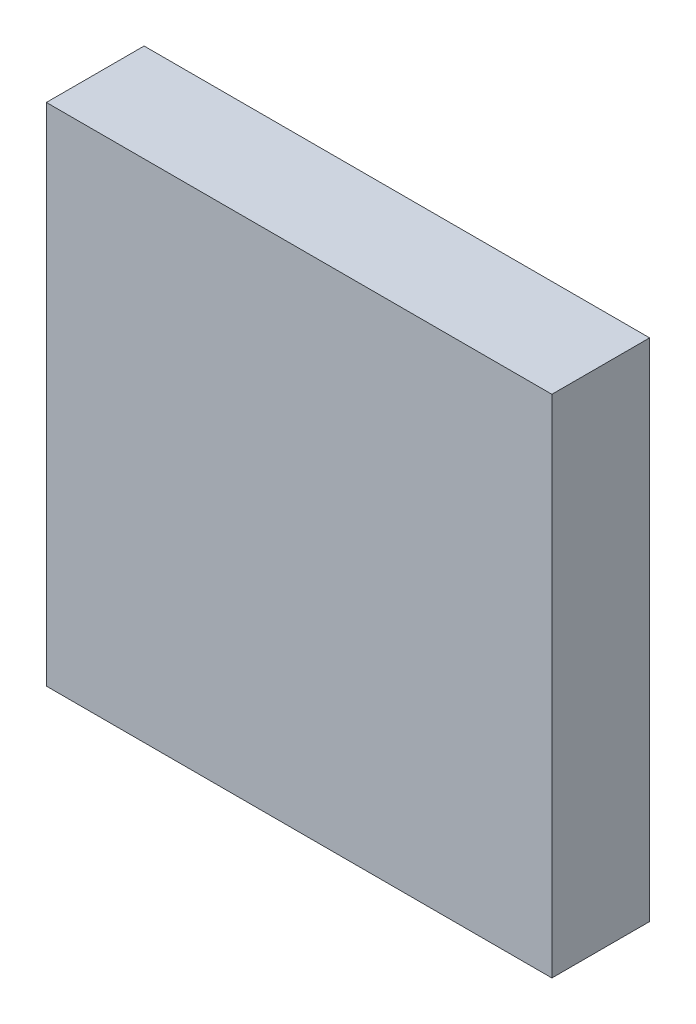
ISO-10303-21;
HEADER;
FILE_DESCRIPTION(('STEP AP214'),'2;1');
FILE_NAME('part.step','',(''),(''),'','','');
FILE_SCHEMA(('AUTOMOTIVE_DESIGN { 1 0 10303 214 1 1 1 1 }'));
ENDSEC;
DATA;
#1=APPLICATION_CONTEXT('core data for automotive mechanical design processes');
#2=APPLICATION_PROTOCOL_DEFINITION('international standard','automotive_design',2000,#1);
#3=PRODUCT_CONTEXT('',#1,'mechanical');
#4=PRODUCT('Part','Part','',(#3));
#5=PRODUCT_RELATED_PRODUCT_CATEGORY('part','',(#4));
#6=PRODUCT_DEFINITION_FORMATION('','',#4);
#7=PRODUCT_DEFINITION_CONTEXT('part definition',#1,'design');
#8=PRODUCT_DEFINITION('design','',#6,#7);
#9=PRODUCT_DEFINITION_SHAPE('','',#8);
#10=(LENGTH_UNIT() NAMED_UNIT(*) SI_UNIT(.MILLI.,.METRE.));
#11=(NAMED_UNIT(*) PLANE_ANGLE_UNIT() SI_UNIT($,.RADIAN.));
#12=(NAMED_UNIT(*) SI_UNIT($,.STERADIAN.) SOLID_ANGLE_UNIT());
#13=UNCERTAINTY_MEASURE_WITH_UNIT(LENGTH_MEASURE(1.E-05),#10,'distance_accuracy_value','');
#14=(GEOMETRIC_REPRESENTATION_CONTEXT(3) GLOBAL_UNCERTAINTY_ASSIGNED_CONTEXT((#13)) GLOBAL_UNIT_ASSIGNED_CONTEXT((#10,
#11,#12)) REPRESENTATION_CONTEXT('',''));
#15=CARTESIAN_POINT('',(0.,0.,0.));
#16=DIRECTION('',(0.,0.,1.));
#17=DIRECTION('',(1.,0.,0.));
#18=AXIS2_PLACEMENT_3D('',#15,#16,#17);
#19=CARTESIAN_POINT('',(-1.49999954,1.49999954,0.58));
#20=DIRECTION('',(0.,0.,-1.));
#21=DIRECTION('',(-1.,0.,0.));
#22=AXIS2_PLACEMENT_3D('',#19,#20,#21);
#23=PLANE('',#22);
#24=DIRECTION('',(1.,0.,0.));
#25=VECTOR('',#24,1.);
#26=CARTESIAN_POINT('',(-1.49999954,-1.49999954,0.58));
#27=LINE('',#26,#25);
#28=CARTESIAN_POINT('',(-1.49999954,-1.49999954,0.58));
#29=VERTEX_POINT('',#28);
#30=CARTESIAN_POINT('',(1.49999954,-1.49999954,0.58));
#31=VERTEX_POINT('',#30);
#32=EDGE_CURVE('E55',#29,#31,#27,.T.);
#33=ORIENTED_EDGE('',*,*,#32,.T.);
#34=DIRECTION('',(0.,1.,0.));
#35=VECTOR('',#34,1.);
#36=CARTESIAN_POINT('',(1.49999954,-1.49999954,0.58));
#37=LINE('',#36,#35);
#38=CARTESIAN_POINT('',(1.49999954,1.49999954,0.58));
#39=VERTEX_POINT('',#38);
#40=EDGE_CURVE('E57',#31,#39,#37,.T.);
#41=ORIENTED_EDGE('',*,*,#40,.T.);
#42=DIRECTION('',(1.,0.,0.));
#43=VECTOR('',#42,1.);
#44=CARTESIAN_POINT('',(1.49999954,1.49999954,0.58));
#45=LINE('',#44,#43);
#46=CARTESIAN_POINT('',(-1.49999954,1.49999954,0.58));
#47=VERTEX_POINT('',#46);
#48=EDGE_CURVE('E20',#39,#47,#45,.F.);
#49=ORIENTED_EDGE('',*,*,#48,.T.);
#50=DIRECTION('',(0.,1.,0.));
#51=VECTOR('',#50,1.);
#52=CARTESIAN_POINT('',(-1.49999954,1.49999954,0.58));
#53=LINE('',#52,#51);
#54=EDGE_CURVE('E80',#47,#29,#53,.F.);
#55=ORIENTED_EDGE('',*,*,#54,.T.);
#56=EDGE_LOOP('',(#33,#41,#49,#55));
#57=FACE_BOUND('',#56,.T.);
#58=ADVANCED_FACE('F17',(#57),#23,.F.);
#59=CARTESIAN_POINT('',(1.49999954,1.49999954,0.));
#60=DIRECTION('',(0.,-1.,0.));
#61=DIRECTION('',(0.,0.,-1.));
#62=AXIS2_PLACEMENT_3D('',#59,#60,#61);
#63=PLANE('',#62);
#64=DIRECTION('',(0.,0.,-1.));
#65=VECTOR('',#64,1.);
#66=CARTESIAN_POINT('',(-1.49999954,1.49999954,0.));
#67=LINE('',#66,#65);
#68=CARTESIAN_POINT('',(-1.49999954,1.49999954,0.));
#69=VERTEX_POINT('',#68);
#70=EDGE_CURVE('E68',#69,#47,#67,.F.);
#71=ORIENTED_EDGE('',*,*,#70,.T.);
#72=ORIENTED_EDGE('',*,*,#48,.F.);
#73=DIRECTION('',(0.,0.,1.));
#74=VECTOR('',#73,1.);
#75=CARTESIAN_POINT('',(1.49999954,1.49999954,0.));
#76=LINE('',#75,#74);
#77=CARTESIAN_POINT('',(1.49999954,1.49999954,0.));
#78=VERTEX_POINT('',#77);
#79=EDGE_CURVE('E63',#39,#78,#76,.F.);
#80=ORIENTED_EDGE('',*,*,#79,.T.);
#81=DIRECTION('',(-1.,0.,0.));
#82=VECTOR('',#81,1.);
#83=CARTESIAN_POINT('',(-1.49999954,1.49999954,0.));
#84=LINE('',#83,#82);
#85=EDGE_CURVE('E83',#69,#78,#84,.F.);
#86=ORIENTED_EDGE('',*,*,#85,.F.);
#87=EDGE_LOOP('',(#71,#72,#80,#86));
#88=FACE_BOUND('',#87,.T.);
#89=ADVANCED_FACE('F65',(#88),#63,.F.);
#90=CARTESIAN_POINT('',(1.49999954,-1.49999954,0.));
#91=DIRECTION('',(-1.,0.,0.));
#92=DIRECTION('',(0.,0.,1.));
#93=AXIS2_PLACEMENT_3D('',#90,#91,#92);
#94=PLANE('',#93);
#95=ORIENTED_EDGE('',*,*,#79,.F.);
#96=ORIENTED_EDGE('',*,*,#40,.F.);
#97=DIRECTION('',(0.,0.,1.));
#98=VECTOR('',#97,1.);
#99=CARTESIAN_POINT('',(1.49999954,-1.49999954,0.));
#100=LINE('',#99,#98);
#101=CARTESIAN_POINT('',(1.49999954,-1.49999954,0.));
#102=VERTEX_POINT('',#101);
#103=EDGE_CURVE('E75',#31,#102,#100,.F.);
#104=ORIENTED_EDGE('',*,*,#103,.T.);
#105=DIRECTION('',(0.,1.,0.));
#106=VECTOR('',#105,1.);
#107=CARTESIAN_POINT('',(1.49999954,1.49999954,0.));
#108=LINE('',#107,#106);
#109=EDGE_CURVE('E72',#78,#102,#108,.F.);
#110=ORIENTED_EDGE('',*,*,#109,.F.);
#111=EDGE_LOOP('',(#95,#96,#104,#110));
#112=FACE_BOUND('',#111,.T.);
#113=ADVANCED_FACE('F70',(#112),#94,.F.);
#114=CARTESIAN_POINT('',(-1.49999954,-1.49999954,0.));
#115=DIRECTION('',(0.,1.,0.));
#116=DIRECTION('',(0.,0.,1.));
#117=AXIS2_PLACEMENT_3D('',#114,#115,#116);
#118=PLANE('',#117);
#119=ORIENTED_EDGE('',*,*,#103,.F.);
#120=ORIENTED_EDGE('',*,*,#32,.F.);
#121=DIRECTION('',(0.,0.,-1.));
#122=VECTOR('',#121,1.);
#123=CARTESIAN_POINT('',(-1.49999954,-1.49999954,0.));
#124=LINE('',#123,#122);
#125=CARTESIAN_POINT('',(-1.49999954,-1.49999954,0.));
#126=VERTEX_POINT('',#125);
#127=EDGE_CURVE('E35',#29,#126,#124,.T.);
#128=ORIENTED_EDGE('',*,*,#127,.T.);
#129=DIRECTION('',(-1.,0.,0.));
#130=VECTOR('',#129,1.);
#131=CARTESIAN_POINT('',(-1.49999954,-1.49999954,0.));
#132=LINE('',#131,#130);
#133=EDGE_CURVE('E26',#102,#126,#132,.T.);
#134=ORIENTED_EDGE('',*,*,#133,.F.);
#135=EDGE_LOOP('',(#119,#120,#128,#134));
#136=FACE_BOUND('',#135,.T.);
#137=ADVANCED_FACE('F89',(#136),#118,.F.);
#138=CARTESIAN_POINT('',(-1.49999954,1.49999954,0.));
#139=DIRECTION('',(1.,0.,0.));
#140=DIRECTION('',(0.,0.,-1.));
#141=AXIS2_PLACEMENT_3D('',#138,#139,#140);
#142=PLANE('',#141);
#143=ORIENTED_EDGE('',*,*,#127,.F.);
#144=ORIENTED_EDGE('',*,*,#54,.F.);
#145=ORIENTED_EDGE('',*,*,#70,.F.);
#146=DIRECTION('',(0.,1.,0.));
#147=VECTOR('',#146,1.);
#148=CARTESIAN_POINT('',(-1.49999954,1.49999954,0.));
#149=LINE('',#148,#147);
#150=EDGE_CURVE('E11',#126,#69,#149,.T.);
#151=ORIENTED_EDGE('',*,*,#150,.F.);
#152=EDGE_LOOP('',(#143,#144,#145,#151));
#153=FACE_BOUND('',#152,.T.);
#154=ADVANCED_FACE('F91',(#153),#142,.F.);
#155=CARTESIAN_POINT('',(-1.49999954,1.49999954,0.));
#156=DIRECTION('',(0.,0.,-1.));
#157=DIRECTION('',(-1.,0.,0.));
#158=AXIS2_PLACEMENT_3D('',#155,#156,#157);
#159=PLANE('',#158);
#160=ORIENTED_EDGE('',*,*,#133,.T.);
#161=ORIENTED_EDGE('',*,*,#150,.T.);
#162=ORIENTED_EDGE('',*,*,#85,.T.);
#163=ORIENTED_EDGE('',*,*,#109,.T.);
#164=EDGE_LOOP('',(#160,#161,#162,#163));
#165=FACE_BOUND('',#164,.T.);
#166=ADVANCED_FACE('F88',(#165),#159,.T.);
#167=CLOSED_SHELL('',(#58,#89,#113,#137,#154,#166));
#168=MANIFOLD_SOLID_BREP('B1',#167);
#169=ADVANCED_BREP_SHAPE_REPRESENTATION('',(#18,#168),#14);
#170=SHAPE_DEFINITION_REPRESENTATION(#9,#169);
ENDSEC;
END-ISO-10303-21;
